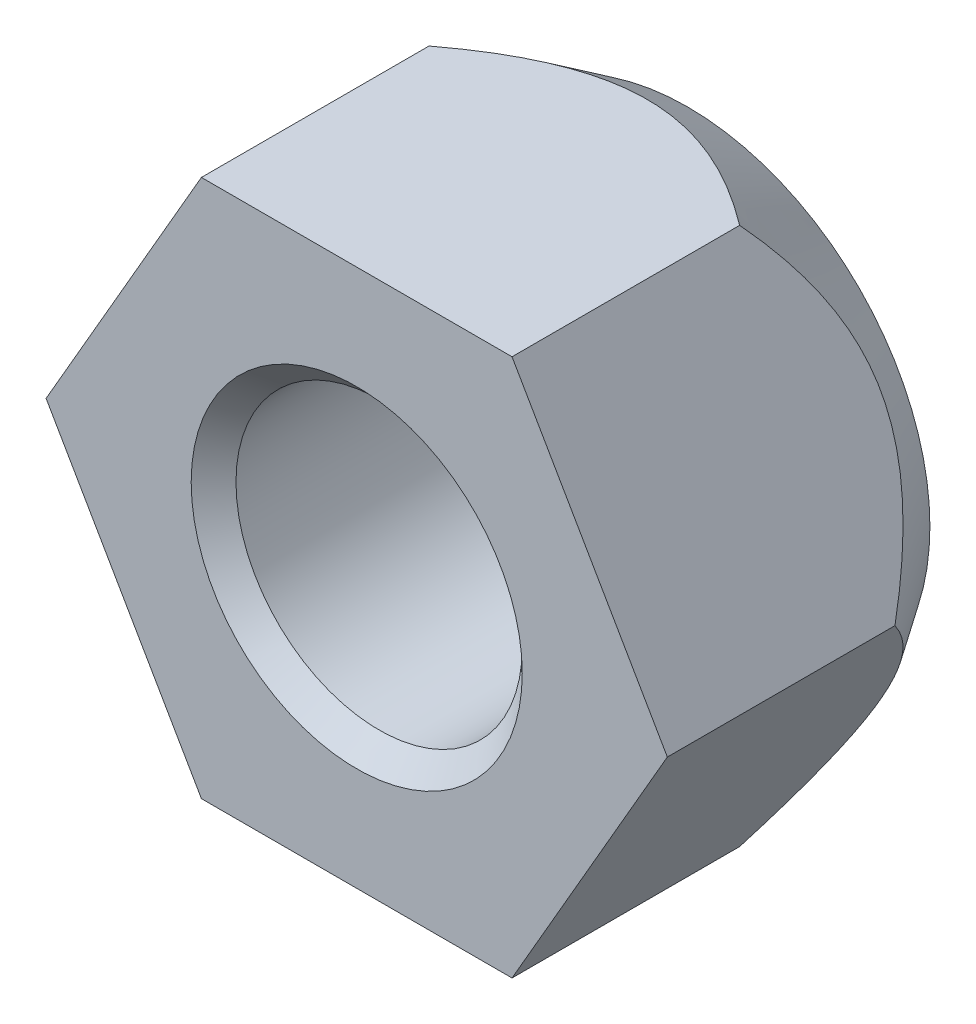
ISO-10303-21;
HEADER;
FILE_DESCRIPTION(('STEP AP214'),'2;1');
FILE_NAME('part.step','',(''),(''),'','','');
FILE_SCHEMA(('AUTOMOTIVE_DESIGN { 1 0 10303 214 1 1 1 1 }'));
ENDSEC;
DATA;
#1=APPLICATION_CONTEXT('core data for automotive mechanical design processes');
#2=APPLICATION_PROTOCOL_DEFINITION('international standard','automotive_design',2000,#1);
#3=PRODUCT_CONTEXT('',#1,'mechanical');
#4=PRODUCT('Part','Part','',(#3));
#5=PRODUCT_RELATED_PRODUCT_CATEGORY('part','',(#4));
#6=PRODUCT_DEFINITION_FORMATION('','',#4);
#7=PRODUCT_DEFINITION_CONTEXT('part definition',#1,'design');
#8=PRODUCT_DEFINITION('design','',#6,#7);
#9=PRODUCT_DEFINITION_SHAPE('','',#8);
#10=(LENGTH_UNIT() NAMED_UNIT(*) SI_UNIT(.MILLI.,.METRE.));
#11=(NAMED_UNIT(*) PLANE_ANGLE_UNIT() SI_UNIT($,.RADIAN.));
#12=(NAMED_UNIT(*) SI_UNIT($,.STERADIAN.) SOLID_ANGLE_UNIT());
#13=UNCERTAINTY_MEASURE_WITH_UNIT(LENGTH_MEASURE(1.E-05),#10,'distance_accuracy_value','');
#14=(GEOMETRIC_REPRESENTATION_CONTEXT(3) GLOBAL_UNCERTAINTY_ASSIGNED_CONTEXT((#13)) GLOBAL_UNIT_ASSIGNED_CONTEXT((#10,
#11,#12)) REPRESENTATION_CONTEXT('',''));
#15=CARTESIAN_POINT('',(0.,0.,0.));
#16=DIRECTION('',(0.,0.,1.));
#17=DIRECTION('',(1.,0.,0.));
#18=AXIS2_PLACEMENT_3D('',#15,#16,#17);
#19=CARTESIAN_POINT('',(0.,0.,0.));
#20=DIRECTION('',(0.,0.,-1.));
#21=DIRECTION('',(1.,0.,0.));
#22=AXIS2_PLACEMENT_3D('',#19,#20,#21);
#23=PLANE('',#22);
#24=DIRECTION('',(-0.5,-0.866025403784439,0.));
#25=VECTOR('',#24,1.);
#26=CARTESIAN_POINT('',(7.50555,0.,0.));
#27=LINE('',#26,#25);
#28=CARTESIAN_POINT('',(7.50555,0.,0.));
#29=VERTEX_POINT('',#28);
#30=CARTESIAN_POINT('',(3.752775,-6.49999696937429,0.));
#31=VERTEX_POINT('',#30);
#32=EDGE_CURVE('E11',#29,#31,#27,.T.);
#33=ORIENTED_EDGE('',*,*,#32,.F.);
#34=DIRECTION('',(0.5,-0.866025403784439,0.));
#35=VECTOR('',#34,1.);
#36=CARTESIAN_POINT('',(3.752775,6.49999696937429,0.));
#37=LINE('',#36,#35);
#38=CARTESIAN_POINT('',(3.752775,6.49999696937429,0.));
#39=VERTEX_POINT('',#38);
#40=EDGE_CURVE('E114',#39,#29,#37,.T.);
#41=ORIENTED_EDGE('',*,*,#40,.F.);
#42=DIRECTION('',(1.,0.,0.));
#43=VECTOR('',#42,1.);
#44=CARTESIAN_POINT('',(-3.752775,6.49999696937429,0.));
#45=LINE('',#44,#43);
#46=CARTESIAN_POINT('',(-3.752775,6.49999696937429,0.));
#47=VERTEX_POINT('',#46);
#48=EDGE_CURVE('E26',#47,#39,#45,.T.);
#49=ORIENTED_EDGE('',*,*,#48,.F.);
#50=DIRECTION('',(0.5,0.866025403784439,0.));
#51=VECTOR('',#50,1.);
#52=CARTESIAN_POINT('',(-7.50555,0.,0.));
#53=LINE('',#52,#51);
#54=CARTESIAN_POINT('',(-7.50555,0.,0.));
#55=VERTEX_POINT('',#54);
#56=EDGE_CURVE('E105',#55,#47,#53,.T.);
#57=ORIENTED_EDGE('',*,*,#56,.F.);
#58=DIRECTION('',(-0.5,0.866025403784439,0.));
#59=VECTOR('',#58,1.);
#60=CARTESIAN_POINT('',(-3.752775,-6.49999696937429,0.));
#61=LINE('',#60,#59);
#62=CARTESIAN_POINT('',(-3.752775,-6.49999696937429,0.));
#63=VERTEX_POINT('',#62);
#64=EDGE_CURVE('E138',#63,#55,#61,.T.);
#65=ORIENTED_EDGE('',*,*,#64,.F.);
#66=DIRECTION('',(-1.,0.,0.));
#67=VECTOR('',#66,1.);
#68=CARTESIAN_POINT('',(3.752775,-6.49999696937429,0.));
#69=LINE('',#68,#67);
#70=EDGE_CURVE('E115',#31,#63,#69,.T.);
#71=ORIENTED_EDGE('',*,*,#70,.F.);
#72=EDGE_LOOP('',(#33,#41,#49,#57,#65,#71));
#73=FACE_BOUND('',#72,.T.);
#74=CARTESIAN_POINT('',(0.,0.,0.));
#75=DIRECTION('',(0.,0.,-1.));
#76=DIRECTION('',(1.,0.,0.));
#77=AXIS2_PLACEMENT_3D('',#74,#75,#76);
#78=CIRCLE('',#77,4.);
#79=CARTESIAN_POINT('',(4.,0.,0.));
#80=VERTEX_POINT('',#79);
#81=EDGE_CURVE('E88',#80,#80,#78,.T.);
#82=ORIENTED_EDGE('',*,*,#81,.T.);
#83=EDGE_LOOP('',(#82));
#84=FACE_BOUND('',#83,.T.);
#85=ADVANCED_FACE('F16',(#73,#84),#23,.F.);
#86=CARTESIAN_POINT('',(5.6291625,-3.24999848468715,0.));
#87=DIRECTION('',(0.866025403784439,-0.5,0.));
#88=DIRECTION('',(-0.5,-0.866025403784439,0.));
#89=AXIS2_PLACEMENT_3D('',#86,#87,#88);
#90=PLANE('',#89);
#91=CARTESIAN_POINT('',(7.50555,0.,-5.5));
#92=CARTESIAN_POINT('',(5.6291625,-3.24999848468714,-8.33348056537103));
#93=CARTESIAN_POINT('',(3.752775,-6.4999969693743,-5.5));
#94=(BOUNDED_CURVE() B_SPLINE_CURVE(2,(#91,#92,#93),.UNSPECIFIED.,.F.,
.F.) B_SPLINE_CURVE_WITH_KNOTS((3,3),(0.,8.09667434477781),
.UNSPECIFIED.) CURVE() GEOMETRIC_REPRESENTATION_ITEM() RATIONAL_B_SPLINE_CURVE((1.,
1.15470053837925,1.)) REPRESENTATION_ITEM(''));
#95=CARTESIAN_POINT('',(7.50555,0.,-5.5));
#96=VERTEX_POINT('',#95);
#97=CARTESIAN_POINT('',(3.752775,-6.49999696937429,-5.5));
#98=VERTEX_POINT('',#97);
#99=EDGE_CURVE('E132',#96,#98,#94,.T.);
#100=ORIENTED_EDGE('',*,*,#99,.F.);
#101=DIRECTION('',(0.,0.,-1.));
#102=VECTOR('',#101,1.);
#103=CARTESIAN_POINT('',(7.50555,0.,0.));
#104=LINE('',#103,#102);
#105=EDGE_CURVE('E46',#29,#96,#104,.T.);
#106=ORIENTED_EDGE('',*,*,#105,.F.);
#107=ORIENTED_EDGE('',*,*,#32,.T.);
#108=DIRECTION('',(0.,0.,-1.));
#109=VECTOR('',#108,1.);
#110=CARTESIAN_POINT('',(3.752775,-6.49999696937429,0.));
#111=LINE('',#110,#109);
#112=EDGE_CURVE('E133',#31,#98,#111,.T.);
#113=ORIENTED_EDGE('',*,*,#112,.T.);
#114=EDGE_LOOP('',(#100,#106,#107,#113));
#115=FACE_BOUND('',#114,.T.);
#116=ADVANCED_FACE('F199',(#115),#90,.T.);
#117=CARTESIAN_POINT('',(0.,6.49999696937429,0.));
#118=DIRECTION('',(0.,1.,0.));
#119=DIRECTION('',(1.,0.,0.));
#120=AXIS2_PLACEMENT_3D('',#117,#118,#119);
#121=PLANE('',#120);
#122=CARTESIAN_POINT('',(-3.752775,6.49999696937429,-5.5));
#123=CARTESIAN_POINT('',(0.,6.49999696937429,-8.33348056537103));
#124=CARTESIAN_POINT('',(3.752775,6.49999696937429,-5.5));
#125=(BOUNDED_CURVE() B_SPLINE_CURVE(2,(#122,#123,#124),.UNSPECIFIED.,.F.,
.F.) B_SPLINE_CURVE_WITH_KNOTS((3,3),(0.,8.09667434477781),
.UNSPECIFIED.) CURVE() GEOMETRIC_REPRESENTATION_ITEM() RATIONAL_B_SPLINE_CURVE((1.,
1.15470053837925,1.)) REPRESENTATION_ITEM(''));
#126=CARTESIAN_POINT('',(-3.752775,6.49999696937429,-5.5));
#127=VERTEX_POINT('',#126);
#128=CARTESIAN_POINT('',(3.752775,6.49999696937429,-5.5));
#129=VERTEX_POINT('',#128);
#130=EDGE_CURVE('E103',#127,#129,#125,.T.);
#131=ORIENTED_EDGE('',*,*,#130,.F.);
#132=DIRECTION('',(0.,0.,-1.));
#133=VECTOR('',#132,1.);
#134=CARTESIAN_POINT('',(-3.752775,6.49999696937429,0.));
#135=LINE('',#134,#133);
#136=EDGE_CURVE('E111',#47,#127,#135,.T.);
#137=ORIENTED_EDGE('',*,*,#136,.F.);
#138=ORIENTED_EDGE('',*,*,#48,.T.);
#139=DIRECTION('',(0.,0.,-1.));
#140=VECTOR('',#139,1.);
#141=CARTESIAN_POINT('',(3.752775,6.49999696937429,0.));
#142=LINE('',#141,#140);
#143=EDGE_CURVE('E57',#39,#129,#142,.T.);
#144=ORIENTED_EDGE('',*,*,#143,.T.);
#145=EDGE_LOOP('',(#131,#137,#138,#144));
#146=FACE_BOUND('',#145,.T.);
#147=ADVANCED_FACE('F204',(#146),#121,.T.);
#148=CARTESIAN_POINT('',(5.6291625,3.24999848468715,0.));
#149=DIRECTION('',(0.866025403784439,0.5,0.));
#150=DIRECTION('',(0.5,-0.866025403784439,0.));
#151=AXIS2_PLACEMENT_3D('',#148,#149,#150);
#152=PLANE('',#151);
#153=CARTESIAN_POINT('',(3.752775,6.49999696937429,-5.5));
#154=CARTESIAN_POINT('',(5.6291625,3.24999848468715,-8.33348056537103));
#155=CARTESIAN_POINT('',(7.50555,0.,-5.5));
#156=(BOUNDED_CURVE() B_SPLINE_CURVE(2,(#153,#154,#155),.UNSPECIFIED.,.F.,
.F.) B_SPLINE_CURVE_WITH_KNOTS((3,3),(0.,8.0966743447778),
.UNSPECIFIED.) CURVE() GEOMETRIC_REPRESENTATION_ITEM() RATIONAL_B_SPLINE_CURVE((1.,
1.15470053837925,1.)) REPRESENTATION_ITEM(''));
#157=EDGE_CURVE('E124',#129,#96,#156,.T.);
#158=ORIENTED_EDGE('',*,*,#157,.F.);
#159=ORIENTED_EDGE('',*,*,#143,.F.);
#160=ORIENTED_EDGE('',*,*,#40,.T.);
#161=ORIENTED_EDGE('',*,*,#105,.T.);
#162=EDGE_LOOP('',(#158,#159,#160,#161));
#163=FACE_BOUND('',#162,.T.);
#164=ADVANCED_FACE('F177',(#163),#152,.T.);
#165=CARTESIAN_POINT('',(0.,0.,-8.));
#166=DIRECTION('',(0.,0.,-1.));
#167=DIRECTION('',(1.,0.,0.));
#168=AXIS2_PLACEMENT_3D('',#165,#166,#167);
#169=PLANE('',#168);
#170=CARTESIAN_POINT('',(0.,0.,-8.));
#171=DIRECTION('',(0.,0.,1.));
#172=DIRECTION('',(1.,0.,0.));
#173=AXIS2_PLACEMENT_3D('',#170,#171,#172);
#174=CIRCLE('',#173,5.85);
#175=CARTESIAN_POINT('',(5.85,0.,-8.));
#176=VERTEX_POINT('',#175);
#177=EDGE_CURVE('E20',#176,#176,#174,.T.);
#178=ORIENTED_EDGE('',*,*,#177,.F.);
#179=EDGE_LOOP('',(#178));
#180=FACE_BOUND('',#179,.T.);
#181=CARTESIAN_POINT('',(0.,0.,-8.));
#182=DIRECTION('',(0.,0.,1.));
#183=DIRECTION('',(1.,0.,0.));
#184=AXIS2_PLACEMENT_3D('',#181,#182,#183);
#185=CIRCLE('',#184,4.);
#186=CARTESIAN_POINT('',(4.,0.,-8.));
#187=VERTEX_POINT('',#186);
#188=EDGE_CURVE('E93',#187,#187,#185,.T.);
#189=ORIENTED_EDGE('',*,*,#188,.T.);
#190=EDGE_LOOP('',(#189));
#191=FACE_BOUND('',#190,.T.);
#192=ADVANCED_FACE('F18',(#180,#191),#169,.T.);
#193=CARTESIAN_POINT('',(0.,-6.49999696937429,0.));
#194=DIRECTION('',(0.,-1.,0.));
#195=DIRECTION('',(-1.,0.,0.));
#196=AXIS2_PLACEMENT_3D('',#193,#194,#195);
#197=PLANE('',#196);
#198=CARTESIAN_POINT('',(3.752775,-6.49999696937429,-5.5));
#199=CARTESIAN_POINT('',(0.,-6.49999696937429,-8.33348056537103));
#200=CARTESIAN_POINT('',(-3.752775,-6.49999696937429,-5.5));
#201=(BOUNDED_CURVE() B_SPLINE_CURVE(2,(#198,#199,#200),.UNSPECIFIED.,.F.,
.F.) B_SPLINE_CURVE_WITH_KNOTS((3,3),(0.,8.09667434477781),
.UNSPECIFIED.) CURVE() GEOMETRIC_REPRESENTATION_ITEM() RATIONAL_B_SPLINE_CURVE((1.,
1.15470053837925,1.)) REPRESENTATION_ITEM(''));
#202=CARTESIAN_POINT('',(-3.752775,-6.4999969693743,-5.5));
#203=VERTEX_POINT('',#202);
#204=EDGE_CURVE('E119',#98,#203,#201,.T.);
#205=ORIENTED_EDGE('',*,*,#204,.F.);
#206=ORIENTED_EDGE('',*,*,#112,.F.);
#207=ORIENTED_EDGE('',*,*,#70,.T.);
#208=DIRECTION('',(0.,0.,-1.));
#209=VECTOR('',#208,1.);
#210=CARTESIAN_POINT('',(-3.752775,-6.49999696937429,0.));
#211=LINE('',#210,#209);
#212=EDGE_CURVE('E118',#63,#203,#211,.T.);
#213=ORIENTED_EDGE('',*,*,#212,.T.);
#214=EDGE_LOOP('',(#205,#206,#207,#213));
#215=FACE_BOUND('',#214,.T.);
#216=ADVANCED_FACE('F176',(#215),#197,.T.);
#217=CARTESIAN_POINT('',(-5.6291625,-3.24999848468715,0.));
#218=DIRECTION('',(-0.866025403784439,-0.5,0.));
#219=DIRECTION('',(-0.5,0.866025403784439,0.));
#220=AXIS2_PLACEMENT_3D('',#217,#218,#219);
#221=PLANE('',#220);
#222=CARTESIAN_POINT('',(-3.752775,-6.4999969693743,-5.5));
#223=CARTESIAN_POINT('',(-5.6291625,-3.24999848468715,-8.33348056537103));
#224=CARTESIAN_POINT('',(-7.50555,0.,-5.5));
#225=(BOUNDED_CURVE() B_SPLINE_CURVE(2,(#222,#223,#224),.UNSPECIFIED.,.F.,
.F.) B_SPLINE_CURVE_WITH_KNOTS((3,3),(0.,8.0966743447778),
.UNSPECIFIED.) CURVE() GEOMETRIC_REPRESENTATION_ITEM() RATIONAL_B_SPLINE_CURVE((1.,
1.15470053837925,1.)) REPRESENTATION_ITEM(''));
#226=CARTESIAN_POINT('',(-7.50555,0.,-5.5));
#227=VERTEX_POINT('',#226);
#228=EDGE_CURVE('E104',#203,#227,#225,.T.);
#229=ORIENTED_EDGE('',*,*,#228,.F.);
#230=ORIENTED_EDGE('',*,*,#212,.F.);
#231=ORIENTED_EDGE('',*,*,#64,.T.);
#232=DIRECTION('',(0.,0.,-1.));
#233=VECTOR('',#232,1.);
#234=CARTESIAN_POINT('',(-7.50555,0.,0.));
#235=LINE('',#234,#233);
#236=EDGE_CURVE('E112',#55,#227,#235,.T.);
#237=ORIENTED_EDGE('',*,*,#236,.T.);
#238=EDGE_LOOP('',(#229,#230,#231,#237));
#239=FACE_BOUND('',#238,.T.);
#240=ADVANCED_FACE('F209',(#239),#221,.T.);
#241=CARTESIAN_POINT('',(-5.6291625,3.24999848468715,0.));
#242=DIRECTION('',(-0.866025403784439,0.5,0.));
#243=DIRECTION('',(0.5,0.866025403784439,0.));
#244=AXIS2_PLACEMENT_3D('',#241,#242,#243);
#245=PLANE('',#244);
#246=CARTESIAN_POINT('',(-7.50555,0.,-5.5));
#247=CARTESIAN_POINT('',(-5.6291625,3.24999848468715,-8.33348056537103));
#248=CARTESIAN_POINT('',(-3.752775,6.49999696937429,-5.5));
#249=(BOUNDED_CURVE() B_SPLINE_CURVE(2,(#246,#247,#248),.UNSPECIFIED.,.F.,
.F.) B_SPLINE_CURVE_WITH_KNOTS((3,3),(0.,8.0966743447778),
.UNSPECIFIED.) CURVE() GEOMETRIC_REPRESENTATION_ITEM() RATIONAL_B_SPLINE_CURVE((1.,
1.15470053837925,1.)) REPRESENTATION_ITEM(''));
#250=EDGE_CURVE('E98',#227,#127,#249,.T.);
#251=ORIENTED_EDGE('',*,*,#250,.F.);
#252=ORIENTED_EDGE('',*,*,#236,.F.);
#253=ORIENTED_EDGE('',*,*,#56,.T.);
#254=ORIENTED_EDGE('',*,*,#136,.T.);
#255=EDGE_LOOP('',(#251,#252,#253,#254));
#256=FACE_BOUND('',#255,.T.);
#257=ADVANCED_FACE('F193',(#256),#245,.T.);
#258=CARTESIAN_POINT('',(0.,0.,-6.75));
#259=DIRECTION('',(0.,0.,1.));
#260=DIRECTION('',(1.,0.,0.));
#261=AXIS2_PLACEMENT_3D('',#258,#259,#260);
#262=CONICAL_SURFACE('',#261,6.677775,0.584917820850616);
#263=ORIENTED_EDGE('',*,*,#177,.T.);
#264=EDGE_LOOP('',(#263));
#265=FACE_BOUND('',#264,.T.);
#266=ORIENTED_EDGE('',*,*,#204,.T.);
#267=ORIENTED_EDGE('',*,*,#228,.T.);
#268=ORIENTED_EDGE('',*,*,#250,.T.);
#269=ORIENTED_EDGE('',*,*,#130,.T.);
#270=ORIENTED_EDGE('',*,*,#157,.T.);
#271=ORIENTED_EDGE('',*,*,#99,.T.);
#272=EDGE_LOOP('',(#266,#267,#268,#269,#270,#271));
#273=FACE_BOUND('',#272,.T.);
#274=ADVANCED_FACE('F171',(#265,#273),#262,.T.);
#275=CARTESIAN_POINT('',(0.,0.,-7.729375));
#276=DIRECTION('',(0.,0.,-1.));
#277=DIRECTION('',(1.,0.,0.));
#278=AXIS2_PLACEMENT_3D('',#275,#276,#277);
#279=CONICAL_SURFACE('',#278,3.729375,0.785398163397448);
#280=CARTESIAN_POINT('',(0.,0.,-7.45875));
#281=DIRECTION('',(0.,0.,-1.));
#282=DIRECTION('',(1.,0.,0.));
#283=AXIS2_PLACEMENT_3D('',#280,#281,#282);
#284=CIRCLE('',#283,3.45875);
#285=CARTESIAN_POINT('',(3.45875,0.,-7.45875));
#286=VERTEX_POINT('',#285);
#287=EDGE_CURVE('E90',#286,#286,#284,.T.);
#288=ORIENTED_EDGE('',*,*,#287,.F.);
#289=EDGE_LOOP('',(#288));
#290=FACE_BOUND('',#289,.T.);
#291=ORIENTED_EDGE('',*,*,#188,.F.);
#292=EDGE_LOOP('',(#291));
#293=FACE_BOUND('',#292,.T.);
#294=ADVANCED_FACE('F180',(#290,#293),#279,.F.);
#295=CARTESIAN_POINT('',(0.,0.,-4.));
#296=DIRECTION('',(0.,0.,1.));
#297=DIRECTION('',(1.,0.,0.));
#298=AXIS2_PLACEMENT_3D('',#295,#296,#297);
#299=CYLINDRICAL_SURFACE('',#298,3.45875);
#300=CARTESIAN_POINT('',(0.,0.,-0.54125));
#301=DIRECTION('',(0.,0.,-1.));
#302=DIRECTION('',(1.,0.,0.));
#303=AXIS2_PLACEMENT_3D('',#300,#301,#302);
#304=CIRCLE('',#303,3.45875);
#305=CARTESIAN_POINT('',(3.45875,0.,-0.54125));
#306=VERTEX_POINT('',#305);
#307=EDGE_CURVE('E91',#306,#306,#304,.T.);
#308=ORIENTED_EDGE('',*,*,#307,.F.);
#309=EDGE_LOOP('',(#308));
#310=FACE_BOUND('',#309,.T.);
#311=ORIENTED_EDGE('',*,*,#287,.T.);
#312=EDGE_LOOP('',(#311));
#313=FACE_BOUND('',#312,.T.);
#314=ADVANCED_FACE('F182',(#310,#313),#299,.F.);
#315=CARTESIAN_POINT('',(0.,0.,-0.270625));
#316=DIRECTION('',(0.,0.,1.));
#317=DIRECTION('',(1.,0.,0.));
#318=AXIS2_PLACEMENT_3D('',#315,#316,#317);
#319=CONICAL_SURFACE('',#318,3.729375,0.785398163397448);
#320=ORIENTED_EDGE('',*,*,#81,.F.);
#321=EDGE_LOOP('',(#320));
#322=FACE_BOUND('',#321,.T.);
#323=ORIENTED_EDGE('',*,*,#307,.T.);
#324=EDGE_LOOP('',(#323));
#325=FACE_BOUND('',#324,.T.);
#326=ADVANCED_FACE('F190',(#322,#325),#319,.F.);
#327=CLOSED_SHELL('',(#85,#116,#147,#164,#192,#216,#240,#257,#274,#294,#314,#326));
#328=MANIFOLD_SOLID_BREP('B1',#327);
#329=ADVANCED_BREP_SHAPE_REPRESENTATION('',(#18,#328),#14);
#330=SHAPE_DEFINITION_REPRESENTATION(#9,#329);
ENDSEC;
END-ISO-10303-21;
